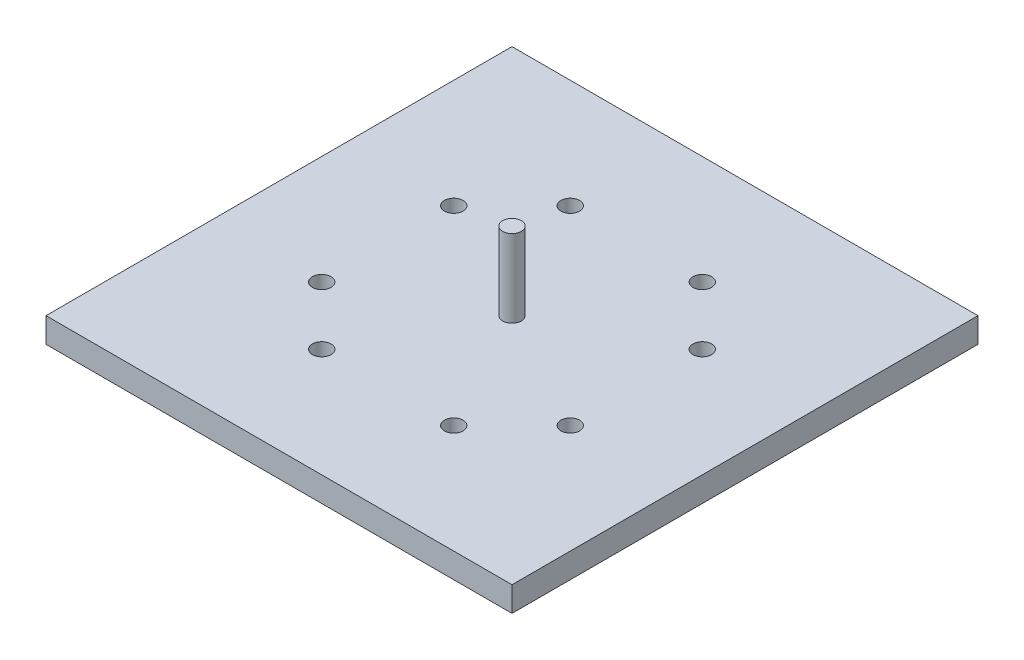
ISO-10303-21;
HEADER;
FILE_DESCRIPTION(('STEP AP214'),'2;1');
FILE_NAME('part.step','',(''),(''),'','','');
FILE_SCHEMA(('AUTOMOTIVE_DESIGN { 1 0 10303 214 1 1 1 1 }'));
ENDSEC;
DATA;
#1=APPLICATION_CONTEXT('core data for automotive mechanical design processes');
#2=APPLICATION_PROTOCOL_DEFINITION('international standard','automotive_design',2000,#1);
#3=PRODUCT_CONTEXT('',#1,'mechanical');
#4=PRODUCT('Part','Part','',(#3));
#5=PRODUCT_RELATED_PRODUCT_CATEGORY('part','',(#4));
#6=PRODUCT_DEFINITION_FORMATION('','',#4);
#7=PRODUCT_DEFINITION_CONTEXT('part definition',#1,'design');
#8=PRODUCT_DEFINITION('design','',#6,#7);
#9=PRODUCT_DEFINITION_SHAPE('','',#8);
#10=(LENGTH_UNIT() NAMED_UNIT(*) SI_UNIT(.MILLI.,.METRE.));
#11=(NAMED_UNIT(*) PLANE_ANGLE_UNIT() SI_UNIT($,.RADIAN.));
#12=(NAMED_UNIT(*) SI_UNIT($,.STERADIAN.) SOLID_ANGLE_UNIT());
#13=UNCERTAINTY_MEASURE_WITH_UNIT(LENGTH_MEASURE(1.E-05),#10,'distance_accuracy_value','');
#14=(GEOMETRIC_REPRESENTATION_CONTEXT(3) GLOBAL_UNCERTAINTY_ASSIGNED_CONTEXT((#13)) GLOBAL_UNIT_ASSIGNED_CONTEXT((#10,
#11,#12)) REPRESENTATION_CONTEXT('',''));
#15=CARTESIAN_POINT('',(0.,0.,0.));
#16=DIRECTION('',(0.,0.,1.));
#17=DIRECTION('',(1.,0.,0.));
#18=AXIS2_PLACEMENT_3D('',#15,#16,#17);
#19=CARTESIAN_POINT('',(0.,1.6,0.));
#20=DIRECTION('',(0.,0.,-1.));
#21=DIRECTION('',(-1.,0.,0.));
#22=AXIS2_PLACEMENT_3D('',#19,#20,#21);
#23=PLANE('',#22);
#24=DIRECTION('',(1.,0.,0.));
#25=VECTOR('',#24,1.);
#26=CARTESIAN_POINT('',(0.,0.,0.));
#27=LINE('',#26,#25);
#28=CARTESIAN_POINT('',(0.,0.,0.));
#29=VERTEX_POINT('',#28);
#30=CARTESIAN_POINT('',(30.,0.,0.));
#31=VERTEX_POINT('',#30);
#32=EDGE_CURVE('E111',#29,#31,#27,.T.);
#33=ORIENTED_EDGE('',*,*,#32,.T.);
#34=DIRECTION('',(0.,-1.,0.));
#35=VECTOR('',#34,1.);
#36=CARTESIAN_POINT('',(30.,1.6,0.));
#37=LINE('',#36,#35);
#38=CARTESIAN_POINT('',(30.,1.6,0.));
#39=VERTEX_POINT('',#38);
#40=EDGE_CURVE('E11',#39,#31,#37,.T.);
#41=ORIENTED_EDGE('',*,*,#40,.F.);
#42=DIRECTION('',(1.,0.,0.));
#43=VECTOR('',#42,1.);
#44=CARTESIAN_POINT('',(0.,1.6,0.));
#45=LINE('',#44,#43);
#46=CARTESIAN_POINT('',(0.,1.6,0.));
#47=VERTEX_POINT('',#46);
#48=EDGE_CURVE('E92',#47,#39,#45,.T.);
#49=ORIENTED_EDGE('',*,*,#48,.F.);
#50=DIRECTION('',(0.,-1.,0.));
#51=VECTOR('',#50,1.);
#52=CARTESIAN_POINT('',(0.,1.6,0.));
#53=LINE('',#52,#51);
#54=EDGE_CURVE('E59',#47,#29,#53,.T.);
#55=ORIENTED_EDGE('',*,*,#54,.T.);
#56=EDGE_LOOP('',(#33,#41,#49,#55));
#57=FACE_BOUND('',#56,.T.);
#58=ADVANCED_FACE('F42',(#57),#23,.F.);
#59=CARTESIAN_POINT('',(30.,1.6,0.));
#60=DIRECTION('',(-1.,0.,0.));
#61=DIRECTION('',(0.,0.,1.));
#62=AXIS2_PLACEMENT_3D('',#59,#60,#61);
#63=PLANE('',#62);
#64=DIRECTION('',(0.,0.,-1.));
#65=VECTOR('',#64,1.);
#66=CARTESIAN_POINT('',(30.,0.,0.));
#67=LINE('',#66,#65);
#68=CARTESIAN_POINT('',(30.,0.,-30.));
#69=VERTEX_POINT('',#68);
#70=EDGE_CURVE('E98',#31,#69,#67,.T.);
#71=ORIENTED_EDGE('',*,*,#70,.T.);
#72=DIRECTION('',(0.,-1.,0.));
#73=VECTOR('',#72,1.);
#74=CARTESIAN_POINT('',(30.,1.6,-30.));
#75=LINE('',#74,#73);
#76=CARTESIAN_POINT('',(30.,1.6,-30.));
#77=VERTEX_POINT('',#76);
#78=EDGE_CURVE('E51',#77,#69,#75,.T.);
#79=ORIENTED_EDGE('',*,*,#78,.F.);
#80=DIRECTION('',(0.,0.,-1.));
#81=VECTOR('',#80,1.);
#82=CARTESIAN_POINT('',(30.,1.6,0.));
#83=LINE('',#82,#81);
#84=EDGE_CURVE('E84',#39,#77,#83,.T.);
#85=ORIENTED_EDGE('',*,*,#84,.F.);
#86=ORIENTED_EDGE('',*,*,#40,.T.);
#87=EDGE_LOOP('',(#71,#79,#85,#86));
#88=FACE_BOUND('',#87,.T.);
#89=ADVANCED_FACE('F97',(#88),#63,.F.);
#90=CARTESIAN_POINT('',(0.,1.6,-30.));
#91=DIRECTION('',(0.,0.,-1.));
#92=DIRECTION('',(-1.,0.,0.));
#93=AXIS2_PLACEMENT_3D('',#90,#91,#92);
#94=PLANE('',#93);
#95=DIRECTION('',(1.,0.,0.));
#96=VECTOR('',#95,1.);
#97=CARTESIAN_POINT('',(0.,0.,-30.));
#98=LINE('',#97,#96);
#99=CARTESIAN_POINT('',(0.,0.,-30.));
#100=VERTEX_POINT('',#99);
#101=EDGE_CURVE('E117',#100,#69,#98,.T.);
#102=ORIENTED_EDGE('',*,*,#101,.F.);
#103=DIRECTION('',(0.,-1.,0.));
#104=VECTOR('',#103,1.);
#105=CARTESIAN_POINT('',(0.,1.6,-30.));
#106=LINE('',#105,#104);
#107=CARTESIAN_POINT('',(0.,1.6,-30.));
#108=VERTEX_POINT('',#107);
#109=EDGE_CURVE('E73',#108,#100,#106,.T.);
#110=ORIENTED_EDGE('',*,*,#109,.F.);
#111=DIRECTION('',(1.,0.,0.));
#112=VECTOR('',#111,1.);
#113=CARTESIAN_POINT('',(0.,1.6,-30.));
#114=LINE('',#113,#112);
#115=EDGE_CURVE('E91',#108,#77,#114,.T.);
#116=ORIENTED_EDGE('',*,*,#115,.T.);
#117=ORIENTED_EDGE('',*,*,#78,.T.);
#118=EDGE_LOOP('',(#102,#110,#116,#117));
#119=FACE_BOUND('',#118,.T.);
#120=ADVANCED_FACE('F102',(#119),#94,.T.);
#121=CARTESIAN_POINT('',(0.,1.6,0.));
#122=DIRECTION('',(-1.,0.,0.));
#123=DIRECTION('',(0.,0.,1.));
#124=AXIS2_PLACEMENT_3D('',#121,#122,#123);
#125=PLANE('',#124);
#126=DIRECTION('',(0.,0.,-1.));
#127=VECTOR('',#126,1.);
#128=CARTESIAN_POINT('',(0.,0.,0.));
#129=LINE('',#128,#127);
#130=EDGE_CURVE('E120',#29,#100,#129,.T.);
#131=ORIENTED_EDGE('',*,*,#130,.F.);
#132=ORIENTED_EDGE('',*,*,#54,.F.);
#133=DIRECTION('',(0.,0.,-1.));
#134=VECTOR('',#133,1.);
#135=CARTESIAN_POINT('',(0.,1.6,0.));
#136=LINE('',#135,#134);
#137=EDGE_CURVE('E104',#47,#108,#136,.T.);
#138=ORIENTED_EDGE('',*,*,#137,.T.);
#139=ORIENTED_EDGE('',*,*,#109,.T.);
#140=EDGE_LOOP('',(#131,#132,#138,#139));
#141=FACE_BOUND('',#140,.T.);
#142=ADVANCED_FACE('F213',(#141),#125,.T.);
#143=CARTESIAN_POINT('',(0.,1.6,0.));
#144=DIRECTION('',(0.,1.,0.));
#145=DIRECTION('',(0.,0.,1.));
#146=AXIS2_PLACEMENT_3D('',#143,#144,#145);
#147=PLANE('',#146);
#148=CARTESIAN_POINT('',(15.,1.6,-15.));
#149=DIRECTION('',(0.,1.,0.));
#150=DIRECTION('',(0.,0.,1.));
#151=AXIS2_PLACEMENT_3D('',#148,#149,#150);
#152=CIRCLE('',#151,0.6);
#153=CARTESIAN_POINT('',(15.,1.6,-14.4));
#154=VERTEX_POINT('',#153);
#155=EDGE_CURVE('E160',#154,#154,#152,.T.);
#156=ORIENTED_EDGE('',*,*,#155,.F.);
#157=EDGE_LOOP('',(#156));
#158=FACE_BOUND('',#157,.T.);
#159=CARTESIAN_POINT('',(23.,1.6,-10.75));
#160=DIRECTION('',(0.,1.,0.));
#161=DIRECTION('',(-1.,0.,0.));
#162=AXIS2_PLACEMENT_3D('',#159,#160,#161);
#163=CIRCLE('',#162,0.6);
#164=CARTESIAN_POINT('',(22.4,1.6,-10.75));
#165=VERTEX_POINT('',#164);
#166=EDGE_CURVE('E170',#165,#165,#163,.T.);
#167=ORIENTED_EDGE('',*,*,#166,.F.);
#168=EDGE_LOOP('',(#167));
#169=FACE_BOUND('',#168,.T.);
#170=CARTESIAN_POINT('',(6.99999999999999,1.6,-19.25));
#171=DIRECTION('',(0.,1.,0.));
#172=DIRECTION('',(-1.,0.,0.));
#173=AXIS2_PLACEMENT_3D('',#170,#171,#172);
#174=CIRCLE('',#173,0.6);
#175=CARTESIAN_POINT('',(6.39999999999999,1.6,-19.25));
#176=VERTEX_POINT('',#175);
#177=EDGE_CURVE('E157',#176,#176,#174,.T.);
#178=ORIENTED_EDGE('',*,*,#177,.F.);
#179=EDGE_LOOP('',(#178));
#180=FACE_BOUND('',#179,.T.);
#181=CARTESIAN_POINT('',(7.00000000000001,1.6,-10.75));
#182=DIRECTION('',(0.,1.,0.));
#183=DIRECTION('',(1.,0.,0.));
#184=AXIS2_PLACEMENT_3D('',#181,#182,#183);
#185=CIRCLE('',#184,0.6);
#186=CARTESIAN_POINT('',(7.60000000000001,1.6,-10.75));
#187=VERTEX_POINT('',#186);
#188=EDGE_CURVE('E158',#187,#187,#185,.T.);
#189=ORIENTED_EDGE('',*,*,#188,.F.);
#190=EDGE_LOOP('',(#189));
#191=FACE_BOUND('',#190,.T.);
#192=CARTESIAN_POINT('',(23.,1.6,-19.25));
#193=DIRECTION('',(0.,1.,0.));
#194=DIRECTION('',(1.,0.,0.));
#195=AXIS2_PLACEMENT_3D('',#192,#193,#194);
#196=CIRCLE('',#195,0.6);
#197=CARTESIAN_POINT('',(23.6,1.6,-19.25));
#198=VERTEX_POINT('',#197);
#199=EDGE_CURVE('E135',#198,#198,#196,.T.);
#200=ORIENTED_EDGE('',*,*,#199,.F.);
#201=EDGE_LOOP('',(#200));
#202=FACE_BOUND('',#201,.T.);
#203=CARTESIAN_POINT('',(10.75,1.6,-7.));
#204=DIRECTION('',(0.,1.,0.));
#205=DIRECTION('',(0.,0.,-1.));
#206=AXIS2_PLACEMENT_3D('',#203,#204,#205);
#207=CIRCLE('',#206,0.6);
#208=CARTESIAN_POINT('',(10.75,1.6,-7.6));
#209=VERTEX_POINT('',#208);
#210=EDGE_CURVE('E145',#209,#209,#207,.T.);
#211=ORIENTED_EDGE('',*,*,#210,.F.);
#212=EDGE_LOOP('',(#211));
#213=FACE_BOUND('',#212,.T.);
#214=CARTESIAN_POINT('',(19.25,1.6,-23.));
#215=DIRECTION('',(0.,1.,0.));
#216=DIRECTION('',(0.,0.,-1.));
#217=AXIS2_PLACEMENT_3D('',#214,#215,#216);
#218=CIRCLE('',#217,0.6);
#219=CARTESIAN_POINT('',(19.25,1.6,-23.6));
#220=VERTEX_POINT('',#219);
#221=EDGE_CURVE('E129',#220,#220,#218,.T.);
#222=ORIENTED_EDGE('',*,*,#221,.F.);
#223=EDGE_LOOP('',(#222));
#224=FACE_BOUND('',#223,.T.);
#225=CARTESIAN_POINT('',(10.75,1.6,-23.));
#226=DIRECTION('',(0.,1.,0.));
#227=DIRECTION('',(0.,0.,1.));
#228=AXIS2_PLACEMENT_3D('',#225,#226,#227);
#229=CIRCLE('',#228,0.6);
#230=CARTESIAN_POINT('',(10.75,1.6,-22.4));
#231=VERTEX_POINT('',#230);
#232=EDGE_CURVE('E141',#231,#231,#229,.T.);
#233=ORIENTED_EDGE('',*,*,#232,.F.);
#234=EDGE_LOOP('',(#233));
#235=FACE_BOUND('',#234,.T.);
#236=CARTESIAN_POINT('',(19.25,1.6,-7.));
#237=DIRECTION('',(0.,1.,0.));
#238=DIRECTION('',(0.,0.,1.));
#239=AXIS2_PLACEMENT_3D('',#236,#237,#238);
#240=CIRCLE('',#239,0.6);
#241=CARTESIAN_POINT('',(19.25,1.6,-6.4));
#242=VERTEX_POINT('',#241);
#243=EDGE_CURVE('E152',#242,#242,#240,.T.);
#244=ORIENTED_EDGE('',*,*,#243,.F.);
#245=EDGE_LOOP('',(#244));
#246=FACE_BOUND('',#245,.T.);
#247=ORIENTED_EDGE('',*,*,#48,.T.);
#248=ORIENTED_EDGE('',*,*,#84,.T.);
#249=ORIENTED_EDGE('',*,*,#115,.F.);
#250=ORIENTED_EDGE('',*,*,#137,.F.);
#251=EDGE_LOOP('',(#247,#248,#249,#250));
#252=FACE_BOUND('',#251,.T.);
#253=ADVANCED_FACE('F88',(#158,#169,#180,#191,#202,#213,#224,#235,#246,#252),#147,.T.);
#254=CARTESIAN_POINT('',(0.,0.,0.));
#255=DIRECTION('',(0.,1.,0.));
#256=DIRECTION('',(0.,0.,1.));
#257=AXIS2_PLACEMENT_3D('',#254,#255,#256);
#258=PLANE('',#257);
#259=CARTESIAN_POINT('',(23.,0.,-10.75));
#260=DIRECTION('',(0.,1.,0.));
#261=DIRECTION('',(-1.,0.,0.));
#262=AXIS2_PLACEMENT_3D('',#259,#260,#261);
#263=CIRCLE('',#262,0.6);
#264=CARTESIAN_POINT('',(22.4,0.,-10.75));
#265=VERTEX_POINT('',#264);
#266=EDGE_CURVE('E138',#265,#265,#263,.T.);
#267=ORIENTED_EDGE('',*,*,#266,.T.);
#268=EDGE_LOOP('',(#267));
#269=FACE_BOUND('',#268,.T.);
#270=CARTESIAN_POINT('',(6.99999999999999,0.,-19.25));
#271=DIRECTION('',(0.,1.,0.));
#272=DIRECTION('',(-1.,0.,0.));
#273=AXIS2_PLACEMENT_3D('',#270,#271,#272);
#274=CIRCLE('',#273,0.6);
#275=CARTESIAN_POINT('',(6.39999999999999,0.,-19.25));
#276=VERTEX_POINT('',#275);
#277=EDGE_CURVE('E174',#276,#276,#274,.T.);
#278=ORIENTED_EDGE('',*,*,#277,.T.);
#279=EDGE_LOOP('',(#278));
#280=FACE_BOUND('',#279,.T.);
#281=CARTESIAN_POINT('',(7.00000000000001,0.,-10.75));
#282=DIRECTION('',(0.,1.,0.));
#283=DIRECTION('',(1.,0.,0.));
#284=AXIS2_PLACEMENT_3D('',#281,#282,#283);
#285=CIRCLE('',#284,0.6);
#286=CARTESIAN_POINT('',(7.60000000000001,0.,-10.75));
#287=VERTEX_POINT('',#286);
#288=EDGE_CURVE('E154',#287,#287,#285,.T.);
#289=ORIENTED_EDGE('',*,*,#288,.T.);
#290=EDGE_LOOP('',(#289));
#291=FACE_BOUND('',#290,.T.);
#292=CARTESIAN_POINT('',(23.,0.,-19.25));
#293=DIRECTION('',(0.,1.,0.));
#294=DIRECTION('',(1.,0.,0.));
#295=AXIS2_PLACEMENT_3D('',#292,#293,#294);
#296=CIRCLE('',#295,0.6);
#297=CARTESIAN_POINT('',(23.6,0.,-19.25));
#298=VERTEX_POINT('',#297);
#299=EDGE_CURVE('E137',#298,#298,#296,.T.);
#300=ORIENTED_EDGE('',*,*,#299,.T.);
#301=EDGE_LOOP('',(#300));
#302=FACE_BOUND('',#301,.T.);
#303=CARTESIAN_POINT('',(10.75,0.,-7.));
#304=DIRECTION('',(0.,1.,0.));
#305=DIRECTION('',(0.,0.,-1.));
#306=AXIS2_PLACEMENT_3D('',#303,#304,#305);
#307=CIRCLE('',#306,0.6);
#308=CARTESIAN_POINT('',(10.75,0.,-7.6));
#309=VERTEX_POINT('',#308);
#310=EDGE_CURVE('E147',#309,#309,#307,.T.);
#311=ORIENTED_EDGE('',*,*,#310,.T.);
#312=EDGE_LOOP('',(#311));
#313=FACE_BOUND('',#312,.T.);
#314=CARTESIAN_POINT('',(19.25,0.,-23.));
#315=DIRECTION('',(0.,1.,0.));
#316=DIRECTION('',(0.,0.,-1.));
#317=AXIS2_PLACEMENT_3D('',#314,#315,#316);
#318=CIRCLE('',#317,0.6);
#319=CARTESIAN_POINT('',(19.25,0.,-23.6));
#320=VERTEX_POINT('',#319);
#321=EDGE_CURVE('E131',#320,#320,#318,.T.);
#322=ORIENTED_EDGE('',*,*,#321,.T.);
#323=EDGE_LOOP('',(#322));
#324=FACE_BOUND('',#323,.T.);
#325=CARTESIAN_POINT('',(10.75,0.,-23.));
#326=DIRECTION('',(0.,1.,0.));
#327=DIRECTION('',(0.,0.,1.));
#328=AXIS2_PLACEMENT_3D('',#325,#326,#327);
#329=CIRCLE('',#328,0.6);
#330=CARTESIAN_POINT('',(10.75,0.,-22.4));
#331=VERTEX_POINT('',#330);
#332=EDGE_CURVE('E132',#331,#331,#329,.T.);
#333=ORIENTED_EDGE('',*,*,#332,.T.);
#334=EDGE_LOOP('',(#333));
#335=FACE_BOUND('',#334,.T.);
#336=CARTESIAN_POINT('',(19.25,0.,-7.));
#337=DIRECTION('',(0.,1.,0.));
#338=DIRECTION('',(0.,0.,1.));
#339=AXIS2_PLACEMENT_3D('',#336,#337,#338);
#340=CIRCLE('',#339,0.6);
#341=CARTESIAN_POINT('',(19.25,0.,-6.4));
#342=VERTEX_POINT('',#341);
#343=EDGE_CURVE('E114',#342,#342,#340,.T.);
#344=ORIENTED_EDGE('',*,*,#343,.T.);
#345=EDGE_LOOP('',(#344));
#346=FACE_BOUND('',#345,.T.);
#347=ORIENTED_EDGE('',*,*,#32,.F.);
#348=ORIENTED_EDGE('',*,*,#130,.T.);
#349=ORIENTED_EDGE('',*,*,#101,.T.);
#350=ORIENTED_EDGE('',*,*,#70,.F.);
#351=EDGE_LOOP('',(#347,#348,#349,#350));
#352=FACE_BOUND('',#351,.T.);
#353=ADVANCED_FACE('F202',(#269,#280,#291,#302,#313,#324,#335,#346,#352),#258,.F.);
#354=CARTESIAN_POINT('',(19.25,0.,-7.));
#355=DIRECTION('',(0.,1.,0.));
#356=DIRECTION('',(0.,0.,1.));
#357=AXIS2_PLACEMENT_3D('',#354,#355,#356);
#358=CYLINDRICAL_SURFACE('',#357,0.6);
#359=ORIENTED_EDGE('',*,*,#343,.F.);
#360=EDGE_LOOP('',(#359));
#361=FACE_BOUND('',#360,.T.);
#362=ORIENTED_EDGE('',*,*,#243,.T.);
#363=EDGE_LOOP('',(#362));
#364=FACE_BOUND('',#363,.T.);
#365=ADVANCED_FACE('F205',(#361,#364),#358,.F.);
#366=CARTESIAN_POINT('',(10.75,0.,-23.));
#367=DIRECTION('',(0.,1.,0.));
#368=DIRECTION('',(0.,0.,1.));
#369=AXIS2_PLACEMENT_3D('',#366,#367,#368);
#370=CYLINDRICAL_SURFACE('',#369,0.6);
#371=ORIENTED_EDGE('',*,*,#332,.F.);
#372=EDGE_LOOP('',(#371));
#373=FACE_BOUND('',#372,.T.);
#374=ORIENTED_EDGE('',*,*,#232,.T.);
#375=EDGE_LOOP('',(#374));
#376=FACE_BOUND('',#375,.T.);
#377=ADVANCED_FACE('F208',(#373,#376),#370,.F.);
#378=CARTESIAN_POINT('',(19.25,0.,-23.));
#379=DIRECTION('',(0.,1.,0.));
#380=DIRECTION('',(0.,0.,1.));
#381=AXIS2_PLACEMENT_3D('',#378,#379,#380);
#382=CYLINDRICAL_SURFACE('',#381,0.6);
#383=ORIENTED_EDGE('',*,*,#321,.F.);
#384=EDGE_LOOP('',(#383));
#385=FACE_BOUND('',#384,.T.);
#386=ORIENTED_EDGE('',*,*,#221,.T.);
#387=EDGE_LOOP('',(#386));
#388=FACE_BOUND('',#387,.T.);
#389=ADVANCED_FACE('F262',(#385,#388),#382,.F.);
#390=CARTESIAN_POINT('',(10.75,0.,-7.));
#391=DIRECTION('',(0.,1.,0.));
#392=DIRECTION('',(0.,0.,1.));
#393=AXIS2_PLACEMENT_3D('',#390,#391,#392);
#394=CYLINDRICAL_SURFACE('',#393,0.6);
#395=ORIENTED_EDGE('',*,*,#310,.F.);
#396=EDGE_LOOP('',(#395));
#397=FACE_BOUND('',#396,.T.);
#398=ORIENTED_EDGE('',*,*,#210,.T.);
#399=EDGE_LOOP('',(#398));
#400=FACE_BOUND('',#399,.T.);
#401=ADVANCED_FACE('F271',(#397,#400),#394,.F.);
#402=CARTESIAN_POINT('',(23.,0.,-19.25));
#403=DIRECTION('',(0.,1.,0.));
#404=DIRECTION('',(0.,0.,1.));
#405=AXIS2_PLACEMENT_3D('',#402,#403,#404);
#406=CYLINDRICAL_SURFACE('',#405,0.6);
#407=ORIENTED_EDGE('',*,*,#299,.F.);
#408=EDGE_LOOP('',(#407));
#409=FACE_BOUND('',#408,.T.);
#410=ORIENTED_EDGE('',*,*,#199,.T.);
#411=EDGE_LOOP('',(#410));
#412=FACE_BOUND('',#411,.T.);
#413=ADVANCED_FACE('F279',(#409,#412),#406,.F.);
#414=CARTESIAN_POINT('',(7.00000000000001,0.,-10.75));
#415=DIRECTION('',(0.,1.,0.));
#416=DIRECTION('',(0.,0.,1.));
#417=AXIS2_PLACEMENT_3D('',#414,#415,#416);
#418=CYLINDRICAL_SURFACE('',#417,0.6);
#419=ORIENTED_EDGE('',*,*,#288,.F.);
#420=EDGE_LOOP('',(#419));
#421=FACE_BOUND('',#420,.T.);
#422=ORIENTED_EDGE('',*,*,#188,.T.);
#423=EDGE_LOOP('',(#422));
#424=FACE_BOUND('',#423,.T.);
#425=ADVANCED_FACE('F287',(#421,#424),#418,.F.);
#426=CARTESIAN_POINT('',(6.99999999999999,0.,-19.25));
#427=DIRECTION('',(0.,1.,0.));
#428=DIRECTION('',(0.,0.,1.));
#429=AXIS2_PLACEMENT_3D('',#426,#427,#428);
#430=CYLINDRICAL_SURFACE('',#429,0.6);
#431=ORIENTED_EDGE('',*,*,#277,.F.);
#432=EDGE_LOOP('',(#431));
#433=FACE_BOUND('',#432,.T.);
#434=ORIENTED_EDGE('',*,*,#177,.T.);
#435=EDGE_LOOP('',(#434));
#436=FACE_BOUND('',#435,.T.);
#437=ADVANCED_FACE('F296',(#433,#436),#430,.F.);
#438=CARTESIAN_POINT('',(23.,0.,-10.75));
#439=DIRECTION('',(0.,1.,0.));
#440=DIRECTION('',(0.,0.,1.));
#441=AXIS2_PLACEMENT_3D('',#438,#439,#440);
#442=CYLINDRICAL_SURFACE('',#441,0.6);
#443=ORIENTED_EDGE('',*,*,#266,.F.);
#444=EDGE_LOOP('',(#443));
#445=FACE_BOUND('',#444,.T.);
#446=ORIENTED_EDGE('',*,*,#166,.T.);
#447=EDGE_LOOP('',(#446));
#448=FACE_BOUND('',#447,.T.);
#449=ADVANCED_FACE('F305',(#445,#448),#442,.F.);
#450=CARTESIAN_POINT('',(15.,6.6,-15.));
#451=DIRECTION('',(0.,-1.,0.));
#452=DIRECTION('',(0.,0.,-1.));
#453=AXIS2_PLACEMENT_3D('',#450,#451,#452);
#454=CYLINDRICAL_SURFACE('',#453,0.6);
#455=CARTESIAN_POINT('',(15.,6.6,-15.));
#456=DIRECTION('',(0.,1.,0.));
#457=DIRECTION('',(0.,0.,1.));
#458=AXIS2_PLACEMENT_3D('',#455,#456,#457);
#459=CIRCLE('',#458,0.6);
#460=CARTESIAN_POINT('',(15.,6.6,-14.4));
#461=VERTEX_POINT('',#460);
#462=EDGE_CURVE('E162',#461,#461,#459,.T.);
#463=ORIENTED_EDGE('',*,*,#462,.F.);
#464=EDGE_LOOP('',(#463));
#465=FACE_BOUND('',#464,.T.);
#466=ORIENTED_EDGE('',*,*,#155,.T.);
#467=EDGE_LOOP('',(#466));
#468=FACE_BOUND('',#467,.T.);
#469=ADVANCED_FACE('F313',(#465,#468),#454,.T.);
#470=CARTESIAN_POINT('',(15.,6.6,-15.));
#471=DIRECTION('',(0.,1.,0.));
#472=DIRECTION('',(0.,0.,1.));
#473=AXIS2_PLACEMENT_3D('',#470,#471,#472);
#474=PLANE('',#473);
#475=ORIENTED_EDGE('',*,*,#462,.T.);
#476=EDGE_LOOP('',(#475));
#477=FACE_BOUND('',#476,.T.);
#478=ADVANCED_FACE('F322',(#477),#474,.T.);
#479=CLOSED_SHELL('',(#58,#89,#120,#142,#253,#353,#365,#377,#389,#401,#413,#425,#437,#449,#469,#478));
#480=MANIFOLD_SOLID_BREP('B2',#479);
#481=ADVANCED_BREP_SHAPE_REPRESENTATION('',(#18,#480),#14);
#482=SHAPE_DEFINITION_REPRESENTATION(#9,#481);
ENDSEC;
END-ISO-10303-21;
